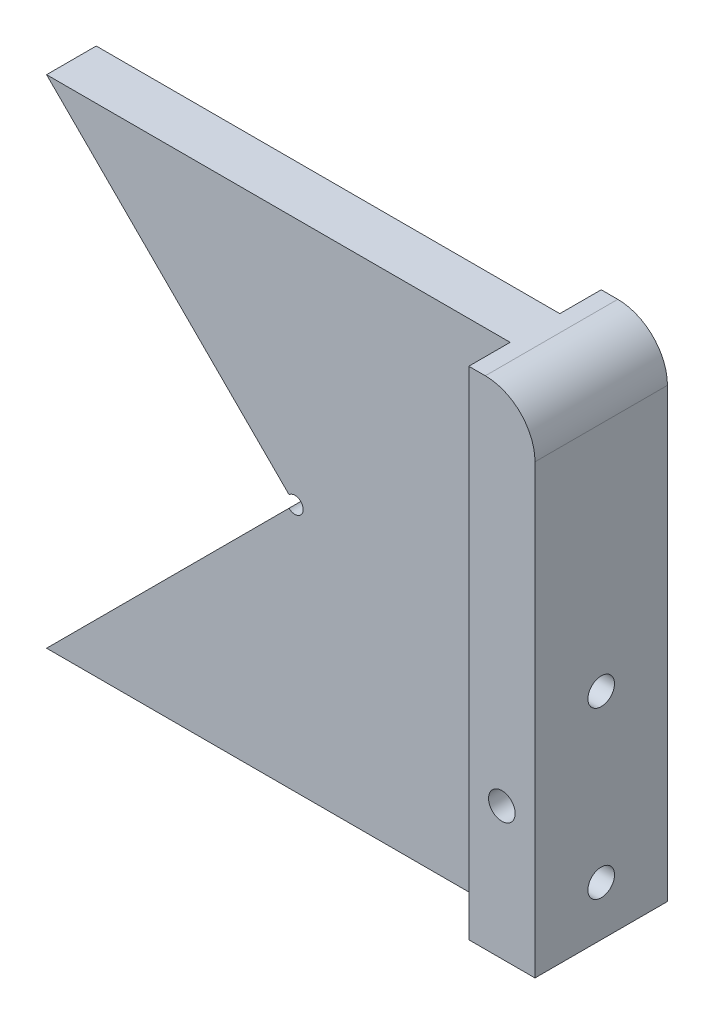
ISO-10303-21;
HEADER;
FILE_DESCRIPTION(('STEP AP214'),'2;1');
FILE_NAME('part.step','',(''),(''),'','','');
FILE_SCHEMA(('AUTOMOTIVE_DESIGN { 1 0 10303 214 1 1 1 1 }'));
ENDSEC;
DATA;
#1=APPLICATION_CONTEXT('core data for automotive mechanical design processes');
#2=APPLICATION_PROTOCOL_DEFINITION('international standard','automotive_design',2000,#1);
#3=PRODUCT_CONTEXT('',#1,'mechanical');
#4=PRODUCT('Part','Part','',(#3));
#5=PRODUCT_RELATED_PRODUCT_CATEGORY('part','',(#4));
#6=PRODUCT_DEFINITION_FORMATION('','',#4);
#7=PRODUCT_DEFINITION_CONTEXT('part definition',#1,'design');
#8=PRODUCT_DEFINITION('design','',#6,#7);
#9=PRODUCT_DEFINITION_SHAPE('','',#8);
#10=(LENGTH_UNIT() NAMED_UNIT(*) SI_UNIT(.MILLI.,.METRE.));
#11=(NAMED_UNIT(*) PLANE_ANGLE_UNIT() SI_UNIT($,.RADIAN.));
#12=(NAMED_UNIT(*) SI_UNIT($,.STERADIAN.) SOLID_ANGLE_UNIT());
#13=UNCERTAINTY_MEASURE_WITH_UNIT(LENGTH_MEASURE(1.E-05),#10,'distance_accuracy_value','');
#14=(GEOMETRIC_REPRESENTATION_CONTEXT(3) GLOBAL_UNCERTAINTY_ASSIGNED_CONTEXT((#13)) GLOBAL_UNIT_ASSIGNED_CONTEXT((#10,
#11,#12)) REPRESENTATION_CONTEXT('',''));
#15=CARTESIAN_POINT('',(0.,0.,0.));
#16=DIRECTION('',(0.,0.,1.));
#17=DIRECTION('',(1.,0.,0.));
#18=AXIS2_PLACEMENT_3D('',#15,#16,#17);
#19=CARTESIAN_POINT('',(0.,0.,4.7625));
#20=DIRECTION('',(0.707106781186544,0.707106781186551,0.));
#21=DIRECTION('',(-0.707106781186551,0.707106781186544,0.));
#22=AXIS2_PLACEMENT_3D('',#19,#20,#21);
#23=PLANE('',#22);
#24=DIRECTION('',(0.707106781186551,-0.707106781186544,0.));
#25=VECTOR('',#24,1.);
#26=CARTESIAN_POINT('',(0.,0.,-4.7625));
#27=LINE('',#26,#25);
#28=CARTESIAN_POINT('',(-47.6250000000005,47.625,-4.7625));
#29=VERTEX_POINT('',#28);
#30=CARTESIAN_POINT('',(-1.12253201513365,1.12253201513364,-4.7625));
#31=VERTEX_POINT('',#30);
#32=EDGE_CURVE('E219',#29,#31,#27,.T.);
#33=ORIENTED_EDGE('',*,*,#32,.T.);
#34=DIRECTION('',(0.,0.,1.));
#35=VECTOR('',#34,1.);
#36=CARTESIAN_POINT('',(-1.12253201513365,1.12253201513364,-4.7625));
#37=LINE('',#36,#35);
#38=CARTESIAN_POINT('',(-1.12253201513365,1.12253201513364,4.7625));
#39=VERTEX_POINT('',#38);
#40=EDGE_CURVE('E215',#31,#39,#37,.T.);
#41=ORIENTED_EDGE('',*,*,#40,.T.);
#42=DIRECTION('',(0.707106781186551,-0.707106781186544,0.));
#43=VECTOR('',#42,1.);
#44=CARTESIAN_POINT('',(0.,0.,4.7625));
#45=LINE('',#44,#43);
#46=CARTESIAN_POINT('',(-47.6250000000005,47.625,4.7625));
#47=VERTEX_POINT('',#46);
#48=EDGE_CURVE('E220',#47,#39,#45,.T.);
#49=ORIENTED_EDGE('',*,*,#48,.F.);
#50=DIRECTION('',(0.,0.,-1.));
#51=VECTOR('',#50,1.);
#52=CARTESIAN_POINT('',(-47.6250000000005,47.625,4.7625));
#53=LINE('',#52,#51);
#54=EDGE_CURVE('E239',#47,#29,#53,.T.);
#55=ORIENTED_EDGE('',*,*,#54,.T.);
#56=EDGE_LOOP('',(#33,#41,#49,#55));
#57=FACE_BOUND('',#56,.T.);
#58=ADVANCED_FACE('F53',(#57),#23,.F.);
#59=CARTESIAN_POINT('',(-47.6250000000005,-47.625,4.7625));
#60=DIRECTION('',(0.707106781186544,-0.707106781186551,0.));
#61=DIRECTION('',(0.707106781186551,0.707106781186544,0.));
#62=AXIS2_PLACEMENT_3D('',#59,#60,#61);
#63=PLANE('',#62);
#64=DIRECTION('',(-0.707106781186551,-0.707106781186544,0.));
#65=VECTOR('',#64,1.);
#66=CARTESIAN_POINT('',(-47.6250000000005,-47.625,4.7625));
#67=LINE('',#66,#65);
#68=CARTESIAN_POINT('',(-1.12253201513366,-1.12253201513363,4.7625));
#69=VERTEX_POINT('',#68);
#70=CARTESIAN_POINT('',(-47.6250000000005,-47.625,4.7625));
#71=VERTEX_POINT('',#70);
#72=EDGE_CURVE('E224',#69,#71,#67,.T.);
#73=ORIENTED_EDGE('',*,*,#72,.F.);
#74=DIRECTION('',(0.,0.,1.));
#75=VECTOR('',#74,1.);
#76=CARTESIAN_POINT('',(-1.12253201513366,-1.12253201513363,-4.7625));
#77=LINE('',#76,#75);
#78=CARTESIAN_POINT('',(-1.12253201513366,-1.12253201513363,-4.7625));
#79=VERTEX_POINT('',#78);
#80=EDGE_CURVE('E211',#69,#79,#77,.F.);
#81=ORIENTED_EDGE('',*,*,#80,.T.);
#82=DIRECTION('',(-0.707106781186551,-0.707106781186544,0.));
#83=VECTOR('',#82,1.);
#84=CARTESIAN_POINT('',(-47.6250000000005,-47.625,-4.7625));
#85=LINE('',#84,#83);
#86=CARTESIAN_POINT('',(-47.6250000000005,-47.625,-4.7625));
#87=VERTEX_POINT('',#86);
#88=EDGE_CURVE('E243',#79,#87,#85,.T.);
#89=ORIENTED_EDGE('',*,*,#88,.T.);
#90=DIRECTION('',(0.,0.,-1.));
#91=VECTOR('',#90,1.);
#92=CARTESIAN_POINT('',(-47.6250000000005,-47.625,4.7625));
#93=LINE('',#92,#91);
#94=EDGE_CURVE('E258',#71,#87,#93,.T.);
#95=ORIENTED_EDGE('',*,*,#94,.F.);
#96=EDGE_LOOP('',(#73,#81,#89,#95));
#97=FACE_BOUND('',#96,.T.);
#98=ADVANCED_FACE('F404',(#97),#63,.F.);
#99=CARTESIAN_POINT('',(41.2749999999995,-47.625,4.7625));
#100=DIRECTION('',(0.,1.,0.));
#101=DIRECTION('',(-1.,0.,0.));
#102=AXIS2_PLACEMENT_3D('',#99,#100,#101);
#103=PLANE('',#102);
#104=DIRECTION('',(1.,0.,0.));
#105=VECTOR('',#104,1.);
#106=CARTESIAN_POINT('',(41.2749999999995,-47.625,-4.7625));
#107=LINE('',#106,#105);
#108=CARTESIAN_POINT('',(41.2749999999995,-47.625,-4.7625));
#109=VERTEX_POINT('',#108);
#110=EDGE_CURVE('E246',#87,#109,#107,.T.);
#111=ORIENTED_EDGE('',*,*,#110,.T.);
#112=DIRECTION('',(0.,0.,-1.));
#113=VECTOR('',#112,1.);
#114=CARTESIAN_POINT('',(41.2749999999995,-47.625,12.7));
#115=LINE('',#114,#113);
#116=CARTESIAN_POINT('',(41.2749999999995,-47.625,-12.7));
#117=VERTEX_POINT('',#116);
#118=EDGE_CURVE('E191',#109,#117,#115,.T.);
#119=ORIENTED_EDGE('',*,*,#118,.T.);
#120=DIRECTION('',(-1.,0.,0.));
#121=VECTOR('',#120,1.);
#122=CARTESIAN_POINT('',(53.9749999999995,-47.625,-12.7));
#123=LINE('',#122,#121);
#124=CARTESIAN_POINT('',(53.9749999999995,-47.625,-12.7));
#125=VERTEX_POINT('',#124);
#126=EDGE_CURVE('E179',#125,#117,#123,.T.);
#127=ORIENTED_EDGE('',*,*,#126,.F.);
#128=DIRECTION('',(0.,0.,-1.));
#129=VECTOR('',#128,1.);
#130=CARTESIAN_POINT('',(53.9749999999995,-47.625,12.7));
#131=LINE('',#130,#129);
#132=CARTESIAN_POINT('',(53.9749999999995,-47.625,12.7));
#133=VERTEX_POINT('',#132);
#134=EDGE_CURVE('E176',#133,#125,#131,.T.);
#135=ORIENTED_EDGE('',*,*,#134,.F.);
#136=DIRECTION('',(-1.,0.,0.));
#137=VECTOR('',#136,1.);
#138=CARTESIAN_POINT('',(53.9749999999995,-47.625,12.7));
#139=LINE('',#138,#137);
#140=CARTESIAN_POINT('',(41.2749999999995,-47.625,12.7));
#141=VERTEX_POINT('',#140);
#142=EDGE_CURVE('E198',#133,#141,#139,.T.);
#143=ORIENTED_EDGE('',*,*,#142,.T.);
#144=CARTESIAN_POINT('',(41.2749999999995,-47.625,4.7625));
#145=VERTEX_POINT('',#144);
#146=EDGE_CURVE('E173',#141,#145,#115,.T.);
#147=ORIENTED_EDGE('',*,*,#146,.T.);
#148=DIRECTION('',(1.,0.,0.));
#149=VECTOR('',#148,1.);
#150=CARTESIAN_POINT('',(41.2749999999995,-47.625,4.7625));
#151=LINE('',#150,#149);
#152=EDGE_CURVE('E228',#71,#145,#151,.T.);
#153=ORIENTED_EDGE('',*,*,#152,.F.);
#154=ORIENTED_EDGE('',*,*,#94,.T.);
#155=EDGE_LOOP('',(#111,#119,#127,#135,#143,#147,#153,#154));
#156=FACE_BOUND('',#155,.T.);
#157=ADVANCED_FACE('F400',(#156),#103,.F.);
#158=CARTESIAN_POINT('',(-47.6250000000005,47.625,4.7625));
#159=DIRECTION('',(0.,-1.,0.));
#160=DIRECTION('',(1.,0.,0.));
#161=AXIS2_PLACEMENT_3D('',#158,#159,#160);
#162=PLANE('',#161);
#163=DIRECTION('',(-1.,0.,0.));
#164=VECTOR('',#163,1.);
#165=CARTESIAN_POINT('',(53.9749999999995,47.625,12.7));
#166=LINE('',#165,#164);
#167=CARTESIAN_POINT('',(44.4499999999995,47.625,12.7));
#168=VERTEX_POINT('',#167);
#169=CARTESIAN_POINT('',(41.2749999999995,47.625,12.7));
#170=VERTEX_POINT('',#169);
#171=EDGE_CURVE('E202',#168,#170,#166,.T.);
#172=ORIENTED_EDGE('',*,*,#171,.F.);
#173=DIRECTION('',(0.,0.,1.));
#174=VECTOR('',#173,1.);
#175=CARTESIAN_POINT('',(44.4499999999995,47.625,4.7625));
#176=LINE('',#175,#174);
#177=CARTESIAN_POINT('',(44.4499999999995,47.625,-12.7));
#178=VERTEX_POINT('',#177);
#179=EDGE_CURVE('E62',#168,#178,#176,.F.);
#180=ORIENTED_EDGE('',*,*,#179,.T.);
#181=DIRECTION('',(-1.,0.,0.));
#182=VECTOR('',#181,1.);
#183=CARTESIAN_POINT('',(53.9749999999995,47.625,-12.7));
#184=LINE('',#183,#182);
#185=CARTESIAN_POINT('',(41.2749999999995,47.625,-12.7));
#186=VERTEX_POINT('',#185);
#187=EDGE_CURVE('E205',#178,#186,#184,.T.);
#188=ORIENTED_EDGE('',*,*,#187,.T.);
#189=DIRECTION('',(0.,0.,1.));
#190=VECTOR('',#189,1.);
#191=CARTESIAN_POINT('',(41.2749999999995,47.625,12.7));
#192=LINE('',#191,#190);
#193=CARTESIAN_POINT('',(41.2749999999995,47.625,-4.7625));
#194=VERTEX_POINT('',#193);
#195=EDGE_CURVE('E184',#186,#194,#192,.T.);
#196=ORIENTED_EDGE('',*,*,#195,.T.);
#197=DIRECTION('',(-1.,0.,0.));
#198=VECTOR('',#197,1.);
#199=CARTESIAN_POINT('',(-47.6250000000005,47.625,-4.7625));
#200=LINE('',#199,#198);
#201=EDGE_CURVE('E225',#194,#29,#200,.T.);
#202=ORIENTED_EDGE('',*,*,#201,.T.);
#203=ORIENTED_EDGE('',*,*,#54,.F.);
#204=DIRECTION('',(-1.,0.,0.));
#205=VECTOR('',#204,1.);
#206=CARTESIAN_POINT('',(-47.6250000000005,47.625,4.7625));
#207=LINE('',#206,#205);
#208=CARTESIAN_POINT('',(41.2749999999995,47.625,4.7625));
#209=VERTEX_POINT('',#208);
#210=EDGE_CURVE('E236',#209,#47,#207,.T.);
#211=ORIENTED_EDGE('',*,*,#210,.F.);
#212=EDGE_CURVE('E183',#209,#170,#192,.T.);
#213=ORIENTED_EDGE('',*,*,#212,.T.);
#214=EDGE_LOOP('',(#172,#180,#188,#196,#202,#203,#211,#213));
#215=FACE_BOUND('',#214,.T.);
#216=ADVANCED_FACE('F376',(#215),#162,.F.);
#217=CARTESIAN_POINT('',(0.,0.,4.7625));
#218=DIRECTION('',(0.,0.,-1.));
#219=DIRECTION('',(-1.,0.,0.));
#220=AXIS2_PLACEMENT_3D('',#217,#218,#219);
#221=PLANE('',#220);
#222=ORIENTED_EDGE('',*,*,#48,.T.);
#223=CARTESIAN_POINT('',(0.,0.,4.7625));
#224=DIRECTION('',(0.,0.,1.));
#225=DIRECTION('',(1.,0.,0.));
#226=AXIS2_PLACEMENT_3D('',#223,#224,#225);
#227=CIRCLE('',#226,1.5875);
#228=EDGE_CURVE('E208',#69,#39,#227,.T.);
#229=ORIENTED_EDGE('',*,*,#228,.F.);
#230=ORIENTED_EDGE('',*,*,#72,.T.);
#231=ORIENTED_EDGE('',*,*,#152,.T.);
#232=DIRECTION('',(0.,1.,0.));
#233=VECTOR('',#232,1.);
#234=CARTESIAN_POINT('',(41.2749999999995,47.625,4.7625));
#235=LINE('',#234,#233);
#236=EDGE_CURVE('E232',#145,#209,#235,.T.);
#237=ORIENTED_EDGE('',*,*,#236,.T.);
#238=ORIENTED_EDGE('',*,*,#210,.T.);
#239=EDGE_LOOP('',(#222,#229,#230,#231,#237,#238));
#240=FACE_BOUND('',#239,.T.);
#241=ADVANCED_FACE('F393',(#240),#221,.F.);
#242=CARTESIAN_POINT('',(0.,0.,-4.7625));
#243=DIRECTION('',(0.,0.,-1.));
#244=DIRECTION('',(-1.,0.,0.));
#245=AXIS2_PLACEMENT_3D('',#242,#243,#244);
#246=PLANE('',#245);
#247=CARTESIAN_POINT('',(0.,0.,-4.7625));
#248=DIRECTION('',(0.,0.,-1.));
#249=DIRECTION('',(-1.,0.,0.));
#250=AXIS2_PLACEMENT_3D('',#247,#248,#249);
#251=CIRCLE('',#250,1.5875);
#252=EDGE_CURVE('E262',#31,#79,#251,.T.);
#253=ORIENTED_EDGE('',*,*,#252,.F.);
#254=ORIENTED_EDGE('',*,*,#32,.F.);
#255=ORIENTED_EDGE('',*,*,#201,.F.);
#256=DIRECTION('',(0.,1.,0.));
#257=VECTOR('',#256,1.);
#258=CARTESIAN_POINT('',(41.2749999999995,47.625,-4.7625));
#259=LINE('',#258,#257);
#260=EDGE_CURVE('E250',#109,#194,#259,.T.);
#261=ORIENTED_EDGE('',*,*,#260,.F.);
#262=ORIENTED_EDGE('',*,*,#110,.F.);
#263=ORIENTED_EDGE('',*,*,#88,.F.);
#264=EDGE_LOOP('',(#253,#254,#255,#261,#262,#263));
#265=FACE_BOUND('',#264,.T.);
#266=ADVANCED_FACE('F384',(#265),#246,.T.);
#267=CARTESIAN_POINT('',(0.,0.,-4.7625));
#268=DIRECTION('',(0.,0.,1.));
#269=DIRECTION('',(1.,0.,0.));
#270=AXIS2_PLACEMENT_3D('',#267,#268,#269);
#271=CYLINDRICAL_SURFACE('',#270,1.5875);
#272=ORIENTED_EDGE('',*,*,#252,.T.);
#273=ORIENTED_EDGE('',*,*,#80,.F.);
#274=ORIENTED_EDGE('',*,*,#228,.T.);
#275=ORIENTED_EDGE('',*,*,#40,.F.);
#276=EDGE_LOOP('',(#272,#273,#274,#275));
#277=FACE_BOUND('',#276,.T.);
#278=ADVANCED_FACE('F406',(#277),#271,.F.);
#279=CARTESIAN_POINT('',(41.2749999999995,0.,0.));
#280=DIRECTION('',(-1.,0.,0.));
#281=DIRECTION('',(0.,0.,1.));
#282=AXIS2_PLACEMENT_3D('',#279,#280,#281);
#283=PLANE('',#282);
#284=ORIENTED_EDGE('',*,*,#236,.F.);
#285=ORIENTED_EDGE('',*,*,#146,.F.);
#286=DIRECTION('',(0.,-1.,0.));
#287=VECTOR('',#286,1.);
#288=CARTESIAN_POINT('',(41.2749999999995,-47.625,12.7));
#289=LINE('',#288,#287);
#290=EDGE_CURVE('E188',#170,#141,#289,.T.);
#291=ORIENTED_EDGE('',*,*,#290,.F.);
#292=ORIENTED_EDGE('',*,*,#212,.F.);
#293=EDGE_LOOP('',(#284,#285,#291,#292));
#294=FACE_BOUND('',#293,.T.);
#295=ADVANCED_FACE('F398',(#294),#283,.T.);
#296=CARTESIAN_POINT('',(53.9749999999995,-47.625,-12.7));
#297=DIRECTION('',(0.,0.,1.));
#298=DIRECTION('',(1.,0.,0.));
#299=AXIS2_PLACEMENT_3D('',#296,#297,#298);
#300=PLANE('',#299);
#301=CARTESIAN_POINT('',(47.6249999999995,-22.225,-12.7));
#302=DIRECTION('',(0.,0.,1.));
#303=DIRECTION('',(1.,0.,0.));
#304=AXIS2_PLACEMENT_3D('',#301,#302,#303);
#305=CIRCLE('',#304,2.5527);
#306=CARTESIAN_POINT('',(50.1776999999995,-22.225,-12.7));
#307=VERTEX_POINT('',#306);
#308=EDGE_CURVE('E160',#307,#307,#305,.T.);
#309=ORIENTED_EDGE('',*,*,#308,.T.);
#310=EDGE_LOOP('',(#309));
#311=FACE_BOUND('',#310,.T.);
#312=ORIENTED_EDGE('',*,*,#187,.F.);
#313=CARTESIAN_POINT('',(44.4499999999995,38.1,-12.7));
#314=DIRECTION('',(0.,0.,1.));
#315=DIRECTION('',(1.,0.,0.));
#316=AXIS2_PLACEMENT_3D('',#313,#314,#315);
#317=CIRCLE('',#316,9.525);
#318=CARTESIAN_POINT('',(53.9749999999995,38.1,-12.7));
#319=VERTEX_POINT('',#318);
#320=EDGE_CURVE('E11',#178,#319,#317,.F.);
#321=ORIENTED_EDGE('',*,*,#320,.T.);
#322=DIRECTION('',(0.,1.,0.));
#323=VECTOR('',#322,1.);
#324=CARTESIAN_POINT('',(53.9749999999995,-47.625,-12.7));
#325=LINE('',#324,#323);
#326=EDGE_CURVE('E168',#125,#319,#325,.T.);
#327=ORIENTED_EDGE('',*,*,#326,.F.);
#328=ORIENTED_EDGE('',*,*,#126,.T.);
#329=DIRECTION('',(0.,1.,0.));
#330=VECTOR('',#329,1.);
#331=CARTESIAN_POINT('',(41.2749999999995,-47.625,-12.7));
#332=LINE('',#331,#330);
#333=EDGE_CURVE('E167',#117,#186,#332,.T.);
#334=ORIENTED_EDGE('',*,*,#333,.T.);
#335=EDGE_LOOP('',(#312,#321,#327,#328,#334));
#336=FACE_BOUND('',#335,.T.);
#337=ADVANCED_FACE('F363',(#311,#336),#300,.F.);
#338=CARTESIAN_POINT('',(53.9749999999995,-47.625,12.7));
#339=DIRECTION('',(0.,0.,-1.));
#340=DIRECTION('',(-1.,0.,0.));
#341=AXIS2_PLACEMENT_3D('',#338,#339,#340);
#342=PLANE('',#341);
#343=CARTESIAN_POINT('',(47.6249999999995,-22.225,12.7));
#344=DIRECTION('',(0.,0.,1.));
#345=DIRECTION('',(1.,0.,0.));
#346=AXIS2_PLACEMENT_3D('',#343,#344,#345);
#347=CIRCLE('',#346,2.5527);
#348=CARTESIAN_POINT('',(50.1776999999995,-22.225,12.7));
#349=VERTEX_POINT('',#348);
#350=EDGE_CURVE('E351',#349,#349,#347,.T.);
#351=ORIENTED_EDGE('',*,*,#350,.F.);
#352=EDGE_LOOP('',(#351));
#353=FACE_BOUND('',#352,.T.);
#354=DIRECTION('',(0.,-1.,0.));
#355=VECTOR('',#354,1.);
#356=CARTESIAN_POINT('',(53.9749999999995,-47.625,12.7));
#357=LINE('',#356,#355);
#358=CARTESIAN_POINT('',(53.9749999999995,38.1,12.7));
#359=VERTEX_POINT('',#358);
#360=EDGE_CURVE('E172',#359,#133,#357,.T.);
#361=ORIENTED_EDGE('',*,*,#360,.F.);
#362=CARTESIAN_POINT('',(44.4499999999995,38.1,12.7));
#363=DIRECTION('',(0.,0.,-1.));
#364=DIRECTION('',(-1.,0.,0.));
#365=AXIS2_PLACEMENT_3D('',#362,#363,#364);
#366=CIRCLE('',#365,9.525);
#367=EDGE_CURVE('E76',#359,#168,#366,.F.);
#368=ORIENTED_EDGE('',*,*,#367,.T.);
#369=ORIENTED_EDGE('',*,*,#171,.T.);
#370=ORIENTED_EDGE('',*,*,#290,.T.);
#371=ORIENTED_EDGE('',*,*,#142,.F.);
#372=EDGE_LOOP('',(#361,#368,#369,#370,#371));
#373=FACE_BOUND('',#372,.T.);
#374=ADVANCED_FACE('F360',(#353,#373),#342,.F.);
#375=CARTESIAN_POINT('',(53.9749999999995,0.,0.));
#376=DIRECTION('',(-1.,0.,0.));
#377=DIRECTION('',(0.,0.,1.));
#378=AXIS2_PLACEMENT_3D('',#375,#376,#377);
#379=PLANE('',#378);
#380=CARTESIAN_POINT('',(53.9749999999995,-38.1,0.));
#381=DIRECTION('',(1.,0.,0.));
#382=DIRECTION('',(0.,0.,-1.));
#383=AXIS2_PLACEMENT_3D('',#380,#381,#382);
#384=CIRCLE('',#383,2.55269999999999);
#385=CARTESIAN_POINT('',(53.9749999999995,-38.1,-2.55269999999999));
#386=VERTEX_POINT('',#385);
#387=EDGE_CURVE('E151',#386,#386,#384,.T.);
#388=ORIENTED_EDGE('',*,*,#387,.F.);
#389=EDGE_LOOP('',(#388));
#390=FACE_BOUND('',#389,.T.);
#391=CARTESIAN_POINT('',(53.9749999999995,-6.34999999999999,0.));
#392=DIRECTION('',(1.,0.,0.));
#393=DIRECTION('',(0.,0.,-1.));
#394=AXIS2_PLACEMENT_3D('',#391,#392,#393);
#395=CIRCLE('',#394,2.55269999999999);
#396=CARTESIAN_POINT('',(53.9749999999995,-6.34999999999999,-2.55269999999999));
#397=VERTEX_POINT('',#396);
#398=EDGE_CURVE('E150',#397,#397,#395,.T.);
#399=ORIENTED_EDGE('',*,*,#398,.F.);
#400=EDGE_LOOP('',(#399));
#401=FACE_BOUND('',#400,.T.);
#402=ORIENTED_EDGE('',*,*,#326,.T.);
#403=DIRECTION('',(0.,0.,1.));
#404=VECTOR('',#403,1.);
#405=CARTESIAN_POINT('',(53.9749999999995,38.1,0.));
#406=LINE('',#405,#404);
#407=EDGE_CURVE('E265',#319,#359,#406,.T.);
#408=ORIENTED_EDGE('',*,*,#407,.T.);
#409=ORIENTED_EDGE('',*,*,#360,.T.);
#410=ORIENTED_EDGE('',*,*,#134,.T.);
#411=EDGE_LOOP('',(#402,#408,#409,#410));
#412=FACE_BOUND('',#411,.T.);
#413=ADVANCED_FACE('F362',(#390,#401,#412),#379,.F.);
#414=ORIENTED_EDGE('',*,*,#118,.F.);
#415=ORIENTED_EDGE('',*,*,#260,.T.);
#416=ORIENTED_EDGE('',*,*,#195,.F.);
#417=ORIENTED_EDGE('',*,*,#333,.F.);
#418=EDGE_LOOP('',(#414,#415,#416,#417));
#419=FACE_BOUND('',#418,.T.);
#420=ADVANCED_FACE('F379',(#419),#283,.T.);
#421=CARTESIAN_POINT('',(44.4499999999995,38.1,0.));
#422=DIRECTION('',(0.,0.,1.));
#423=DIRECTION('',(1.,0.,0.));
#424=AXIS2_PLACEMENT_3D('',#421,#422,#423);
#425=CYLINDRICAL_SURFACE('',#424,9.525);
#426=ORIENTED_EDGE('',*,*,#320,.F.);
#427=ORIENTED_EDGE('',*,*,#179,.F.);
#428=ORIENTED_EDGE('',*,*,#367,.F.);
#429=ORIENTED_EDGE('',*,*,#407,.F.);
#430=EDGE_LOOP('',(#426,#427,#428,#429));
#431=FACE_BOUND('',#430,.T.);
#432=ADVANCED_FACE('F55',(#431),#425,.T.);
#433=CARTESIAN_POINT('',(38.0999999999995,-6.34999999999999,0.));
#434=DIRECTION('',(1.,0.,0.));
#435=DIRECTION('',(0.,0.,-1.));
#436=AXIS2_PLACEMENT_3D('',#433,#434,#435);
#437=CONICAL_SURFACE('',#436,2.5527,1.02974425867665);
#438=CARTESIAN_POINT('',(36.5661830978078,-6.35,0.));
#439=VERTEX_POINT('',#438);
#440=VERTEX_LOOP('',#439);
#441=FACE_BOUND('',#440,.T.);
#442=CARTESIAN_POINT('',(38.0999999999995,-6.34999999999999,0.));
#443=DIRECTION('',(1.,0.,0.));
#444=DIRECTION('',(0.,0.,-1.));
#445=AXIS2_PLACEMENT_3D('',#442,#443,#444);
#446=CIRCLE('',#445,2.5527);
#447=CARTESIAN_POINT('',(38.0999999999995,-6.34999999999999,-2.5527));
#448=VERTEX_POINT('',#447);
#449=EDGE_CURVE('E157',#448,#448,#446,.T.);
#450=ORIENTED_EDGE('',*,*,#449,.T.);
#451=EDGE_LOOP('',(#450));
#452=FACE_BOUND('',#451,.T.);
#453=ADVANCED_FACE('F469',(#441,#452),#437,.F.);
#454=CARTESIAN_POINT('',(53.9749999999995,-6.34999999999999,0.));
#455=DIRECTION('',(1.,0.,0.));
#456=DIRECTION('',(0.,0.,-1.));
#457=AXIS2_PLACEMENT_3D('',#454,#455,#456);
#458=CYLINDRICAL_SURFACE('',#457,2.55269999999999);
#459=ORIENTED_EDGE('',*,*,#449,.F.);
#460=EDGE_LOOP('',(#459));
#461=FACE_BOUND('',#460,.T.);
#462=ORIENTED_EDGE('',*,*,#398,.T.);
#463=EDGE_LOOP('',(#462));
#464=FACE_BOUND('',#463,.T.);
#465=ADVANCED_FACE('F143',(#461,#464),#458,.F.);
#466=CARTESIAN_POINT('',(38.0999999999995,-38.1,0.));
#467=DIRECTION('',(1.,0.,0.));
#468=DIRECTION('',(0.,0.,-1.));
#469=AXIS2_PLACEMENT_3D('',#466,#467,#468);
#470=CONICAL_SURFACE('',#469,2.5527,1.02974425867665);
#471=CARTESIAN_POINT('',(36.5661830978078,-38.1,0.));
#472=VERTEX_POINT('',#471);
#473=VERTEX_LOOP('',#472);
#474=FACE_BOUND('',#473,.T.);
#475=CARTESIAN_POINT('',(38.0999999999995,-38.1,0.));
#476=DIRECTION('',(1.,0.,0.));
#477=DIRECTION('',(0.,0.,-1.));
#478=AXIS2_PLACEMENT_3D('',#475,#476,#477);
#479=CIRCLE('',#478,2.5527);
#480=CARTESIAN_POINT('',(38.0999999999995,-38.1,-2.5527));
#481=VERTEX_POINT('',#480);
#482=EDGE_CURVE('E147',#481,#481,#479,.T.);
#483=ORIENTED_EDGE('',*,*,#482,.T.);
#484=EDGE_LOOP('',(#483));
#485=FACE_BOUND('',#484,.T.);
#486=ADVANCED_FACE('F139',(#474,#485),#470,.F.);
#487=CARTESIAN_POINT('',(53.9749999999995,-38.1,0.));
#488=DIRECTION('',(1.,0.,0.));
#489=DIRECTION('',(0.,0.,-1.));
#490=AXIS2_PLACEMENT_3D('',#487,#488,#489);
#491=CYLINDRICAL_SURFACE('',#490,2.55269999999999);
#492=ORIENTED_EDGE('',*,*,#482,.F.);
#493=EDGE_LOOP('',(#492));
#494=FACE_BOUND('',#493,.T.);
#495=ORIENTED_EDGE('',*,*,#387,.T.);
#496=EDGE_LOOP('',(#495));
#497=FACE_BOUND('',#496,.T.);
#498=ADVANCED_FACE('F142',(#494,#497),#491,.F.);
#499=CARTESIAN_POINT('',(47.6249999999995,-22.225,12.7));
#500=DIRECTION('',(0.,0.,1.));
#501=DIRECTION('',(1.,0.,0.));
#502=AXIS2_PLACEMENT_3D('',#499,#500,#501);
#503=CYLINDRICAL_SURFACE('',#502,2.5527);
#504=ORIENTED_EDGE('',*,*,#308,.F.);
#505=EDGE_LOOP('',(#504));
#506=FACE_BOUND('',#505,.T.);
#507=ORIENTED_EDGE('',*,*,#350,.T.);
#508=EDGE_LOOP('',(#507));
#509=FACE_BOUND('',#508,.T.);
#510=ADVANCED_FACE('F358',(#506,#509),#503,.F.);
#511=CLOSED_SHELL('',(#58,#98,#157,#216,#241,#266,#278,#295,#337,#374,#413,#420,#432,#453,#465,
#486,#498,#510));
#512=MANIFOLD_SOLID_BREP('B2',#511);
#513=ADVANCED_BREP_SHAPE_REPRESENTATION('',(#18,#512),#14);
#514=SHAPE_DEFINITION_REPRESENTATION(#9,#513);
ENDSEC;
END-ISO-10303-21;
